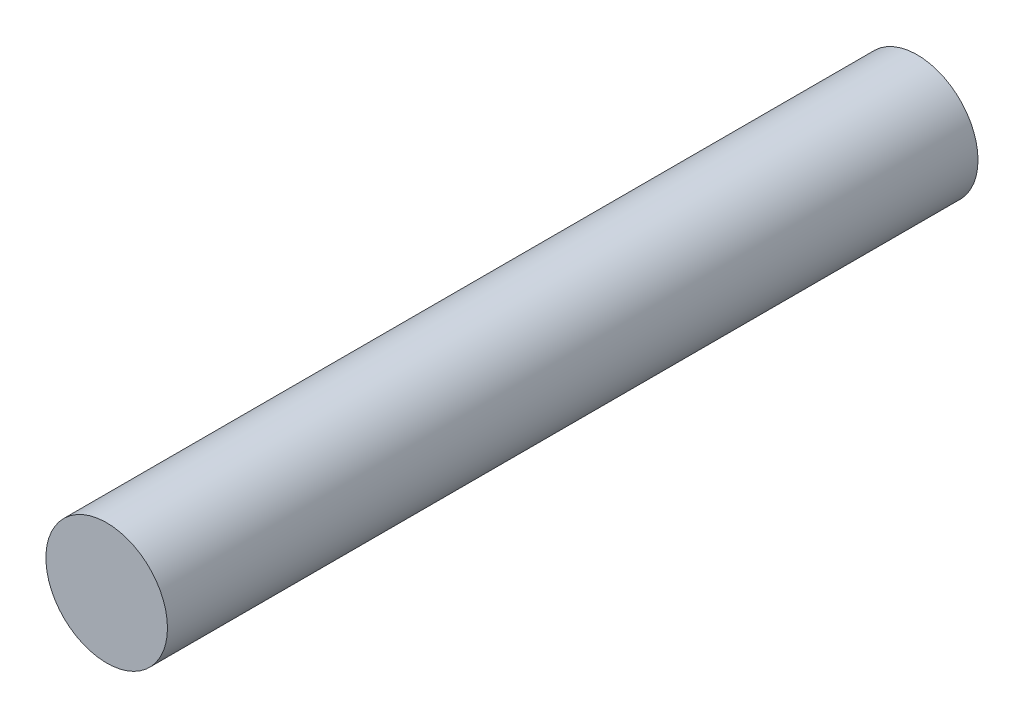
ISO-10303-21;
HEADER;
FILE_DESCRIPTION(('STEP AP214'),'2;1');
FILE_NAME('part.step','',(''),(''),'','','');
FILE_SCHEMA(('AUTOMOTIVE_DESIGN { 1 0 10303 214 1 1 1 1 }'));
ENDSEC;
DATA;
#1=APPLICATION_CONTEXT('core data for automotive mechanical design processes');
#2=APPLICATION_PROTOCOL_DEFINITION('international standard','automotive_design',2000,#1);
#3=PRODUCT_CONTEXT('',#1,'mechanical');
#4=PRODUCT('Part','Part','',(#3));
#5=PRODUCT_RELATED_PRODUCT_CATEGORY('part','',(#4));
#6=PRODUCT_DEFINITION_FORMATION('','',#4);
#7=PRODUCT_DEFINITION_CONTEXT('part definition',#1,'design');
#8=PRODUCT_DEFINITION('design','',#6,#7);
#9=PRODUCT_DEFINITION_SHAPE('','',#8);
#10=(LENGTH_UNIT() NAMED_UNIT(*) SI_UNIT(.MILLI.,.METRE.));
#11=(NAMED_UNIT(*) PLANE_ANGLE_UNIT() SI_UNIT($,.RADIAN.));
#12=(NAMED_UNIT(*) SI_UNIT($,.STERADIAN.) SOLID_ANGLE_UNIT());
#13=UNCERTAINTY_MEASURE_WITH_UNIT(LENGTH_MEASURE(1.E-05),#10,'distance_accuracy_value','');
#14=(GEOMETRIC_REPRESENTATION_CONTEXT(3) GLOBAL_UNCERTAINTY_ASSIGNED_CONTEXT((#13)) GLOBAL_UNIT_ASSIGNED_CONTEXT((#10,
#11,#12)) REPRESENTATION_CONTEXT('',''));
#15=CARTESIAN_POINT('',(0.,0.,0.));
#16=DIRECTION('',(0.,0.,1.));
#17=DIRECTION('',(1.,0.,0.));
#18=AXIS2_PLACEMENT_3D('',#15,#16,#17);
#19=CARTESIAN_POINT('',(0.,0.,63.5));
#20=DIRECTION('',(0.,0.,-1.));
#21=DIRECTION('',(-1.,0.,0.));
#22=AXIS2_PLACEMENT_3D('',#19,#20,#21);
#23=CYLINDRICAL_SURFACE('',#22,4.7625);
#24=CARTESIAN_POINT('',(0.,0.,63.5));
#25=DIRECTION('',(0.,0.,1.));
#26=DIRECTION('',(1.,0.,0.));
#27=AXIS2_PLACEMENT_3D('',#24,#25,#26);
#28=CIRCLE('',#27,4.7625);
#29=CARTESIAN_POINT('',(4.7625,0.,63.5));
#30=VERTEX_POINT('',#29);
#31=EDGE_CURVE('E10',#30,#30,#28,.T.);
#32=ORIENTED_EDGE('',*,*,#31,.F.);
#33=EDGE_LOOP('',(#32));
#34=FACE_BOUND('',#33,.T.);
#35=CARTESIAN_POINT('',(0.,0.,0.));
#36=DIRECTION('',(0.,0.,1.));
#37=DIRECTION('',(1.,0.,0.));
#38=AXIS2_PLACEMENT_3D('',#35,#36,#37);
#39=CIRCLE('',#38,4.7625);
#40=CARTESIAN_POINT('',(4.7625,0.,0.));
#41=VERTEX_POINT('',#40);
#42=EDGE_CURVE('E33',#41,#41,#39,.T.);
#43=ORIENTED_EDGE('',*,*,#42,.T.);
#44=EDGE_LOOP('',(#43));
#45=FACE_BOUND('',#44,.T.);
#46=ADVANCED_FACE('F30',(#34,#45),#23,.T.);
#47=CARTESIAN_POINT('',(0.,0.,63.5));
#48=DIRECTION('',(0.,0.,1.));
#49=DIRECTION('',(1.,0.,0.));
#50=AXIS2_PLACEMENT_3D('',#47,#48,#49);
#51=PLANE('',#50);
#52=ORIENTED_EDGE('',*,*,#31,.T.);
#53=EDGE_LOOP('',(#52));
#54=FACE_BOUND('',#53,.T.);
#55=ADVANCED_FACE('F45',(#54),#51,.T.);
#56=CARTESIAN_POINT('',(0.,0.,0.));
#57=DIRECTION('',(0.,0.,1.));
#58=DIRECTION('',(1.,0.,0.));
#59=AXIS2_PLACEMENT_3D('',#56,#57,#58);
#60=PLANE('',#59);
#61=ORIENTED_EDGE('',*,*,#42,.F.);
#62=EDGE_LOOP('',(#61));
#63=FACE_BOUND('',#62,.T.);
#64=ADVANCED_FACE('F43',(#63),#60,.F.);
#65=CLOSED_SHELL('',(#46,#55,#64));
#66=MANIFOLD_SOLID_BREP('B2',#65);
#67=ADVANCED_BREP_SHAPE_REPRESENTATION('',(#18,#66),#14);
#68=SHAPE_DEFINITION_REPRESENTATION(#9,#67);
ENDSEC;
END-ISO-10303-21;
